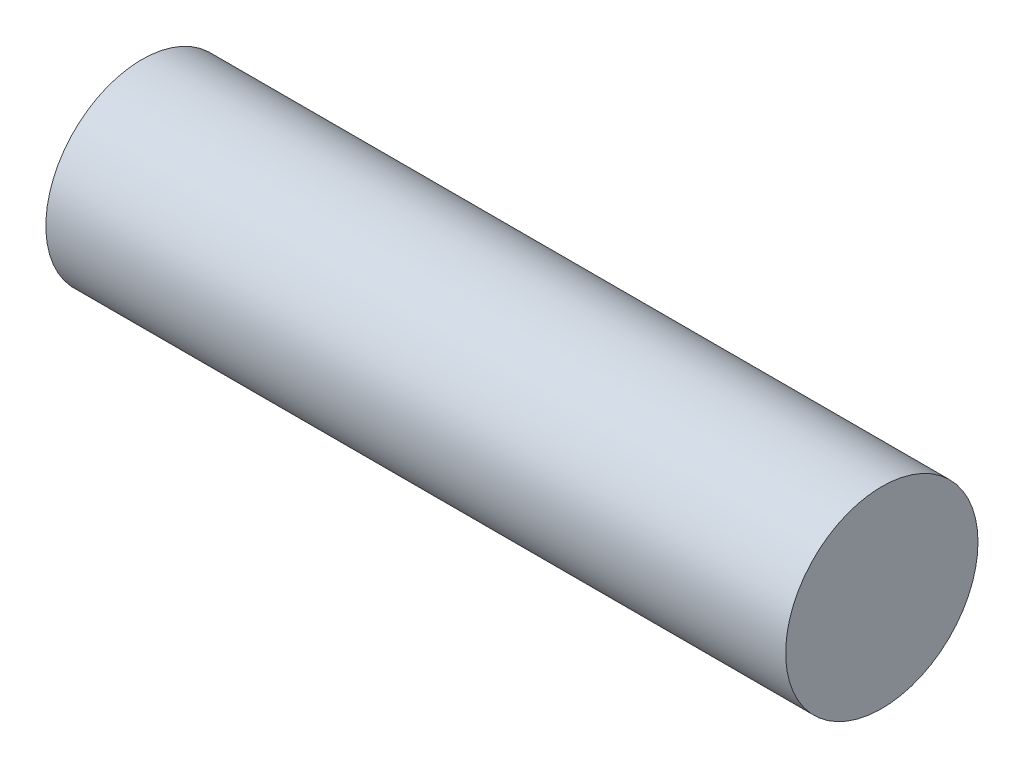
ISO-10303-21;
HEADER;
FILE_DESCRIPTION(('STEP AP214'),'2;1');
FILE_NAME('part.step','',(''),(''),'','','');
FILE_SCHEMA(('AUTOMOTIVE_DESIGN { 1 0 10303 214 1 1 1 1 }'));
ENDSEC;
DATA;
#1=APPLICATION_CONTEXT('core data for automotive mechanical design processes');
#2=APPLICATION_PROTOCOL_DEFINITION('international standard','automotive_design',2000,#1);
#3=PRODUCT_CONTEXT('',#1,'mechanical');
#4=PRODUCT('Part','Part','',(#3));
#5=PRODUCT_RELATED_PRODUCT_CATEGORY('part','',(#4));
#6=PRODUCT_DEFINITION_FORMATION('','',#4);
#7=PRODUCT_DEFINITION_CONTEXT('part definition',#1,'design');
#8=PRODUCT_DEFINITION('design','',#6,#7);
#9=PRODUCT_DEFINITION_SHAPE('','',#8);
#10=(LENGTH_UNIT() NAMED_UNIT(*) SI_UNIT(.MILLI.,.METRE.));
#11=(NAMED_UNIT(*) PLANE_ANGLE_UNIT() SI_UNIT($,.RADIAN.));
#12=(NAMED_UNIT(*) SI_UNIT($,.STERADIAN.) SOLID_ANGLE_UNIT());
#13=UNCERTAINTY_MEASURE_WITH_UNIT(LENGTH_MEASURE(1.E-05),#10,'distance_accuracy_value','');
#14=(GEOMETRIC_REPRESENTATION_CONTEXT(3) GLOBAL_UNCERTAINTY_ASSIGNED_CONTEXT((#13)) GLOBAL_UNIT_ASSIGNED_CONTEXT((#10,
#11,#12)) REPRESENTATION_CONTEXT('',''));
#15=CARTESIAN_POINT('',(0.,0.,0.));
#16=DIRECTION('',(0.,0.,1.));
#17=DIRECTION('',(1.,0.,0.));
#18=AXIS2_PLACEMENT_3D('',#15,#16,#17);
#19=CARTESIAN_POINT('',(2000.,0.,0.));
#20=DIRECTION('',(1.,0.,0.));
#21=DIRECTION('',(0.,0.,-1.));
#22=AXIS2_PLACEMENT_3D('',#19,#20,#21);
#23=PLANE('',#22);
#24=CARTESIAN_POINT('',(2000.,0.,0.));
#25=DIRECTION('',(1.,0.,0.));
#26=DIRECTION('',(0.,0.,-1.));
#27=AXIS2_PLACEMENT_3D('',#24,#25,#26);
#28=CIRCLE('',#27,260.);
#29=CARTESIAN_POINT('',(2000.,0.,-260.));
#30=VERTEX_POINT('',#29);
#31=EDGE_CURVE('E50',#30,#30,#28,.T.);
#32=ORIENTED_EDGE('',*,*,#31,.T.);
#33=EDGE_LOOP('',(#32));
#34=FACE_BOUND('',#33,.T.);
#35=ADVANCED_FACE('F42',(#34),#23,.T.);
#36=CARTESIAN_POINT('',(0.,0.,0.));
#37=DIRECTION('',(1.,0.,0.));
#38=DIRECTION('',(0.,0.,-1.));
#39=AXIS2_PLACEMENT_3D('',#36,#37,#38);
#40=PLANE('',#39);
#41=CARTESIAN_POINT('',(0.,0.,0.));
#42=DIRECTION('',(1.,0.,0.));
#43=DIRECTION('',(0.,0.,-1.));
#44=AXIS2_PLACEMENT_3D('',#41,#42,#43);
#45=CIRCLE('',#44,260.);
#46=CARTESIAN_POINT('',(0.,0.,-260.));
#47=VERTEX_POINT('',#46);
#48=EDGE_CURVE('E54',#47,#47,#45,.T.);
#49=ORIENTED_EDGE('',*,*,#48,.F.);
#50=EDGE_LOOP('',(#49));
#51=FACE_BOUND('',#50,.T.);
#52=ADVANCED_FACE('F80',(#51),#40,.F.);
#53=CARTESIAN_POINT('',(2000.,0.,0.));
#54=DIRECTION('',(-1.,0.,0.));
#55=DIRECTION('',(0.,0.,1.));
#56=AXIS2_PLACEMENT_3D('',#53,#54,#55);
#57=CYLINDRICAL_SURFACE('',#56,260.);
#58=ORIENTED_EDGE('',*,*,#31,.F.);
#59=EDGE_LOOP('',(#58));
#60=FACE_BOUND('',#59,.T.);
#61=ORIENTED_EDGE('',*,*,#48,.T.);
#62=EDGE_LOOP('',(#61));
#63=FACE_BOUND('',#62,.T.);
#64=ADVANCED_FACE('F44',(#60,#63),#57,.T.);
#65=CLOSED_SHELL('',(#35,#52,#64));
#66=CARTESIAN_POINT('',(10.,0.,0.));
#67=DIRECTION('',(1.,0.,0.));
#68=DIRECTION('',(0.,0.,-1.));
#69=AXIS2_PLACEMENT_3D('',#66,#67,#68);
#70=PLANE('',#69);
#71=CARTESIAN_POINT('',(10.,0.,0.));
#72=DIRECTION('',(1.,0.,0.));
#73=DIRECTION('',(0.,0.,-1.));
#74=AXIS2_PLACEMENT_3D('',#71,#72,#73);
#75=CIRCLE('',#74,250.);
#76=CARTESIAN_POINT('',(10.,0.,-250.));
#77=VERTEX_POINT('',#76);
#78=EDGE_CURVE('E11',#77,#77,#75,.T.);
#79=ORIENTED_EDGE('',*,*,#78,.T.);
#80=EDGE_LOOP('',(#79));
#81=FACE_BOUND('',#80,.T.);
#82=ADVANCED_FACE('F68',(#81),#70,.T.);
#83=CARTESIAN_POINT('',(1990.,0.,0.));
#84=DIRECTION('',(1.,0.,0.));
#85=DIRECTION('',(0.,0.,-1.));
#86=AXIS2_PLACEMENT_3D('',#83,#84,#85);
#87=PLANE('',#86);
#88=CARTESIAN_POINT('',(1990.,0.,0.));
#89=DIRECTION('',(1.,0.,0.));
#90=DIRECTION('',(0.,0.,-1.));
#91=AXIS2_PLACEMENT_3D('',#88,#89,#90);
#92=CIRCLE('',#91,250.);
#93=CARTESIAN_POINT('',(1990.,0.,-250.));
#94=VERTEX_POINT('',#93);
#95=EDGE_CURVE('E59',#94,#94,#92,.T.);
#96=ORIENTED_EDGE('',*,*,#95,.F.);
#97=EDGE_LOOP('',(#96));
#98=FACE_BOUND('',#97,.T.);
#99=ADVANCED_FACE('F66',(#98),#87,.F.);
#100=CARTESIAN_POINT('',(2000.,0.,0.));
#101=DIRECTION('',(-1.,0.,0.));
#102=DIRECTION('',(0.,0.,1.));
#103=AXIS2_PLACEMENT_3D('',#100,#101,#102);
#104=CYLINDRICAL_SURFACE('',#103,250.);
#105=ORIENTED_EDGE('',*,*,#78,.F.);
#106=EDGE_LOOP('',(#105));
#107=FACE_BOUND('',#106,.T.);
#108=ORIENTED_EDGE('',*,*,#95,.T.);
#109=EDGE_LOOP('',(#108));
#110=FACE_BOUND('',#109,.T.);
#111=ADVANCED_FACE('F64',(#107,#110),#104,.F.);
#112=CLOSED_SHELL('',(#82,#99,#111));
#113=ORIENTED_CLOSED_SHELL('',*,#112,.T.);
#114=BREP_WITH_VOIDS('B2',#65,(#113));
#115=ADVANCED_BREP_SHAPE_REPRESENTATION('',(#18,#114),#14);
#116=SHAPE_DEFINITION_REPRESENTATION(#9,#115);
ENDSEC;
END-ISO-10303-21;
